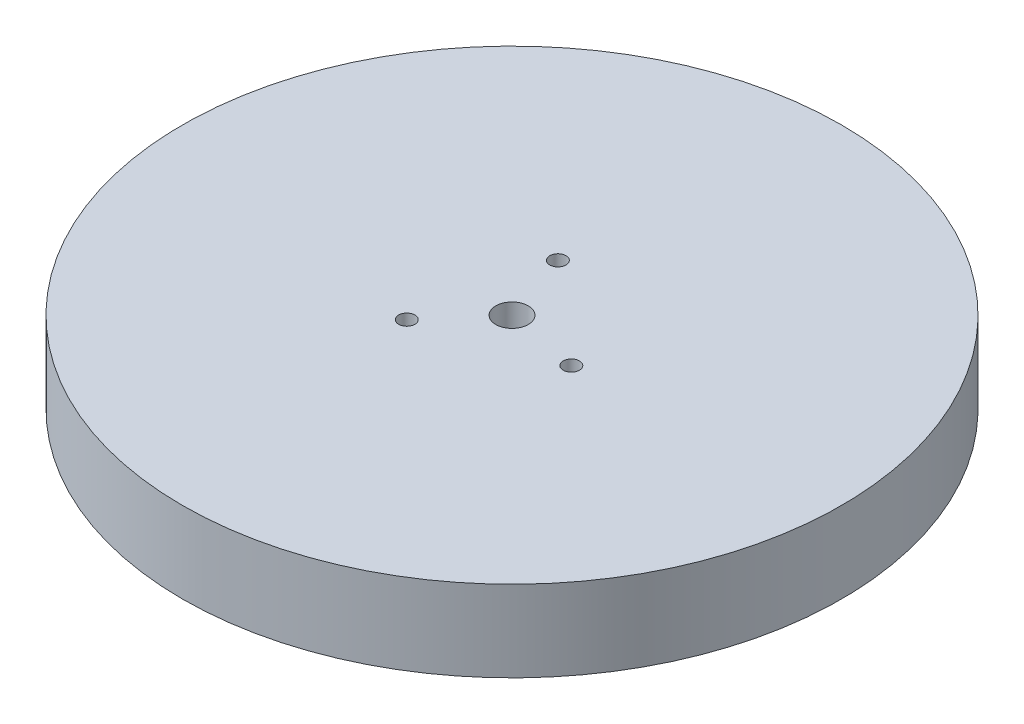
ISO-10303-21;
HEADER;
FILE_DESCRIPTION(('STEP AP214'),'2;1');
FILE_NAME('part.step','',(''),(''),'','','');
FILE_SCHEMA(('AUTOMOTIVE_DESIGN { 1 0 10303 214 1 1 1 1 }'));
ENDSEC;
DATA;
#1=APPLICATION_CONTEXT('core data for automotive mechanical design processes');
#2=APPLICATION_PROTOCOL_DEFINITION('international standard','automotive_design',2000,#1);
#3=PRODUCT_CONTEXT('',#1,'mechanical');
#4=PRODUCT('Part','Part','',(#3));
#5=PRODUCT_RELATED_PRODUCT_CATEGORY('part','',(#4));
#6=PRODUCT_DEFINITION_FORMATION('','',#4);
#7=PRODUCT_DEFINITION_CONTEXT('part definition',#1,'design');
#8=PRODUCT_DEFINITION('design','',#6,#7);
#9=PRODUCT_DEFINITION_SHAPE('','',#8);
#10=(LENGTH_UNIT() NAMED_UNIT(*) SI_UNIT(.MILLI.,.METRE.));
#11=(NAMED_UNIT(*) PLANE_ANGLE_UNIT() SI_UNIT($,.RADIAN.));
#12=(NAMED_UNIT(*) SI_UNIT($,.STERADIAN.) SOLID_ANGLE_UNIT());
#13=UNCERTAINTY_MEASURE_WITH_UNIT(LENGTH_MEASURE(1.E-05),#10,'distance_accuracy_value','');
#14=(GEOMETRIC_REPRESENTATION_CONTEXT(3) GLOBAL_UNCERTAINTY_ASSIGNED_CONTEXT((#13)) GLOBAL_UNIT_ASSIGNED_CONTEXT((#10,
#11,#12)) REPRESENTATION_CONTEXT('',''));
#15=CARTESIAN_POINT('',(0.,0.,0.));
#16=DIRECTION('',(0.,0.,1.));
#17=DIRECTION('',(1.,0.,0.));
#18=AXIS2_PLACEMENT_3D('',#15,#16,#17);
#19=CARTESIAN_POINT('',(0.,25.,0.));
#20=DIRECTION('',(0.,1.,0.));
#21=DIRECTION('',(0.,0.,1.));
#22=AXIS2_PLACEMENT_3D('',#19,#20,#21);
#23=PLANE('',#22);
#24=CARTESIAN_POINT('',(22.5930732102235,25.,4.3073243339085));
#25=DIRECTION('',(0.,-1.,0.));
#26=DIRECTION('',(0.,0.,-1.));
#27=AXIS2_PLACEMENT_3D('',#24,#25,#26);
#28=CIRCLE('',#27,2.5);
#29=CARTESIAN_POINT('',(22.5930732102235,25.,1.80732433390851));
#30=VERTEX_POINT('',#29);
#31=EDGE_CURVE('E57',#30,#30,#28,.T.);
#32=ORIENTED_EDGE('',*,*,#31,.T.);
#33=EDGE_LOOP('',(#32));
#34=FACE_BOUND('',#33,.T.);
#35=CARTESIAN_POINT('',(-7.56628430960807,25.,-21.7198375165695));
#36=DIRECTION('',(0.,-1.,0.));
#37=DIRECTION('',(0.,0.,-1.));
#38=AXIS2_PLACEMENT_3D('',#35,#36,#37);
#39=CIRCLE('',#38,2.5);
#40=CARTESIAN_POINT('',(-7.56628430960807,25.,-24.2198375165695));
#41=VERTEX_POINT('',#40);
#42=EDGE_CURVE('E69',#41,#41,#39,.T.);
#43=ORIENTED_EDGE('',*,*,#42,.T.);
#44=EDGE_LOOP('',(#43));
#45=FACE_BOUND('',#44,.T.);
#46=CARTESIAN_POINT('',(-15.0267889006154,25.,17.412513182661));
#47=DIRECTION('',(0.,-1.,0.));
#48=DIRECTION('',(0.,0.,-1.));
#49=AXIS2_PLACEMENT_3D('',#46,#47,#48);
#50=CIRCLE('',#49,2.5);
#51=CARTESIAN_POINT('',(-15.0267889006154,25.,14.912513182661));
#52=VERTEX_POINT('',#51);
#53=EDGE_CURVE('E63',#52,#52,#50,.T.);
#54=ORIENTED_EDGE('',*,*,#53,.T.);
#55=EDGE_LOOP('',(#54));
#56=FACE_BOUND('',#55,.T.);
#57=CARTESIAN_POINT('',(0.,25.,0.));
#58=DIRECTION('',(0.,1.,0.));
#59=DIRECTION('',(0.,0.,1.));
#60=AXIS2_PLACEMENT_3D('',#57,#58,#59);
#61=CIRCLE('',#60,101.6);
#62=CARTESIAN_POINT('',(0.,25.,101.6));
#63=VERTEX_POINT('',#62);
#64=EDGE_CURVE('E11',#63,#63,#61,.T.);
#65=ORIENTED_EDGE('',*,*,#64,.T.);
#66=EDGE_LOOP('',(#65));
#67=FACE_BOUND('',#66,.T.);
#68=CARTESIAN_POINT('',(0.,25.,0.));
#69=DIRECTION('',(0.,1.,0.));
#70=DIRECTION('',(0.,0.,1.));
#71=AXIS2_PLACEMENT_3D('',#68,#69,#70);
#72=CIRCLE('',#71,5.);
#73=CARTESIAN_POINT('',(0.,25.,5.));
#74=VERTEX_POINT('',#73);
#75=EDGE_CURVE('E52',#74,#74,#72,.T.);
#76=ORIENTED_EDGE('',*,*,#75,.F.);
#77=EDGE_LOOP('',(#76));
#78=FACE_BOUND('',#77,.T.);
#79=ADVANCED_FACE('F41',(#34,#45,#56,#67,#78),#23,.T.);
#80=CARTESIAN_POINT('',(0.,0.,0.));
#81=DIRECTION('',(0.,1.,0.));
#82=DIRECTION('',(0.,0.,1.));
#83=AXIS2_PLACEMENT_3D('',#80,#81,#82);
#84=PLANE('',#83);
#85=CARTESIAN_POINT('',(22.5930732102235,0.,4.3073243339085));
#86=DIRECTION('',(0.,-1.,0.));
#87=DIRECTION('',(0.,0.,-1.));
#88=AXIS2_PLACEMENT_3D('',#85,#86,#87);
#89=CIRCLE('',#88,2.5);
#90=CARTESIAN_POINT('',(22.5930732102235,0.,1.80732433390851));
#91=VERTEX_POINT('',#90);
#92=EDGE_CURVE('E72',#91,#91,#89,.T.);
#93=ORIENTED_EDGE('',*,*,#92,.F.);
#94=EDGE_LOOP('',(#93));
#95=FACE_BOUND('',#94,.T.);
#96=CARTESIAN_POINT('',(-7.56628430960807,0.,-21.7198375165695));
#97=DIRECTION('',(0.,-1.,0.));
#98=DIRECTION('',(0.,0.,-1.));
#99=AXIS2_PLACEMENT_3D('',#96,#97,#98);
#100=CIRCLE('',#99,2.5);
#101=CARTESIAN_POINT('',(-7.56628430960807,0.,-24.2198375165695));
#102=VERTEX_POINT('',#101);
#103=EDGE_CURVE('E66',#102,#102,#100,.T.);
#104=ORIENTED_EDGE('',*,*,#103,.F.);
#105=EDGE_LOOP('',(#104));
#106=FACE_BOUND('',#105,.T.);
#107=CARTESIAN_POINT('',(-15.0267889006154,0.,17.412513182661));
#108=DIRECTION('',(0.,-1.,0.));
#109=DIRECTION('',(0.,0.,-1.));
#110=AXIS2_PLACEMENT_3D('',#107,#108,#109);
#111=CIRCLE('',#110,2.5);
#112=CARTESIAN_POINT('',(-15.0267889006154,0.,14.912513182661));
#113=VERTEX_POINT('',#112);
#114=EDGE_CURVE('E60',#113,#113,#111,.T.);
#115=ORIENTED_EDGE('',*,*,#114,.F.);
#116=EDGE_LOOP('',(#115));
#117=FACE_BOUND('',#116,.T.);
#118=CARTESIAN_POINT('',(0.,0.,0.));
#119=DIRECTION('',(0.,1.,0.));
#120=DIRECTION('',(0.,0.,1.));
#121=AXIS2_PLACEMENT_3D('',#118,#119,#120);
#122=CIRCLE('',#121,101.6);
#123=CARTESIAN_POINT('',(0.,0.,101.6));
#124=VERTEX_POINT('',#123);
#125=EDGE_CURVE('E45',#124,#124,#122,.T.);
#126=ORIENTED_EDGE('',*,*,#125,.F.);
#127=EDGE_LOOP('',(#126));
#128=FACE_BOUND('',#127,.T.);
#129=CARTESIAN_POINT('',(0.,0.,0.));
#130=DIRECTION('',(0.,1.,0.));
#131=DIRECTION('',(0.,0.,1.));
#132=AXIS2_PLACEMENT_3D('',#129,#130,#131);
#133=CIRCLE('',#132,5.);
#134=CARTESIAN_POINT('',(0.,0.,5.));
#135=VERTEX_POINT('',#134);
#136=EDGE_CURVE('E54',#135,#135,#133,.T.);
#137=ORIENTED_EDGE('',*,*,#136,.T.);
#138=EDGE_LOOP('',(#137));
#139=FACE_BOUND('',#138,.T.);
#140=ADVANCED_FACE('F87',(#95,#106,#117,#128,#139),#84,.F.);
#141=CARTESIAN_POINT('',(0.,25.,0.));
#142=DIRECTION('',(0.,-1.,0.));
#143=DIRECTION('',(0.,0.,-1.));
#144=AXIS2_PLACEMENT_3D('',#141,#142,#143);
#145=CYLINDRICAL_SURFACE('',#144,101.6);
#146=ORIENTED_EDGE('',*,*,#64,.F.);
#147=EDGE_LOOP('',(#146));
#148=FACE_BOUND('',#147,.T.);
#149=ORIENTED_EDGE('',*,*,#125,.T.);
#150=EDGE_LOOP('',(#149));
#151=FACE_BOUND('',#150,.T.);
#152=ADVANCED_FACE('F43',(#148,#151),#145,.T.);
#153=CARTESIAN_POINT('',(0.,25.,0.));
#154=DIRECTION('',(0.,-1.,0.));
#155=DIRECTION('',(0.,0.,-1.));
#156=AXIS2_PLACEMENT_3D('',#153,#154,#155);
#157=CYLINDRICAL_SURFACE('',#156,5.);
#158=ORIENTED_EDGE('',*,*,#75,.T.);
#159=EDGE_LOOP('',(#158));
#160=FACE_BOUND('',#159,.T.);
#161=ORIENTED_EDGE('',*,*,#136,.F.);
#162=EDGE_LOOP('',(#161));
#163=FACE_BOUND('',#162,.T.);
#164=ADVANCED_FACE('F98',(#160,#163),#157,.F.);
#165=CARTESIAN_POINT('',(-15.0267889006154,25.,17.412513182661));
#166=DIRECTION('',(0.,-1.,0.));
#167=DIRECTION('',(0.,0.,-1.));
#168=AXIS2_PLACEMENT_3D('',#165,#166,#167);
#169=CYLINDRICAL_SURFACE('',#168,2.5);
#170=ORIENTED_EDGE('',*,*,#53,.F.);
#171=EDGE_LOOP('',(#170));
#172=FACE_BOUND('',#171,.T.);
#173=ORIENTED_EDGE('',*,*,#114,.T.);
#174=EDGE_LOOP('',(#173));
#175=FACE_BOUND('',#174,.T.);
#176=ADVANCED_FACE('F100',(#172,#175),#169,.F.);
#177=CARTESIAN_POINT('',(-7.56628430960807,25.,-21.7198375165695));
#178=DIRECTION('',(0.,-1.,0.));
#179=DIRECTION('',(0.,0.,-1.));
#180=AXIS2_PLACEMENT_3D('',#177,#178,#179);
#181=CYLINDRICAL_SURFACE('',#180,2.5);
#182=ORIENTED_EDGE('',*,*,#42,.F.);
#183=EDGE_LOOP('',(#182));
#184=FACE_BOUND('',#183,.T.);
#185=ORIENTED_EDGE('',*,*,#103,.T.);
#186=EDGE_LOOP('',(#185));
#187=FACE_BOUND('',#186,.T.);
#188=ADVANCED_FACE('F83',(#184,#187),#181,.F.);
#189=CARTESIAN_POINT('',(22.5930732102235,25.,4.3073243339085));
#190=DIRECTION('',(0.,-1.,0.));
#191=DIRECTION('',(0.,0.,-1.));
#192=AXIS2_PLACEMENT_3D('',#189,#190,#191);
#193=CYLINDRICAL_SURFACE('',#192,2.5);
#194=ORIENTED_EDGE('',*,*,#31,.F.);
#195=EDGE_LOOP('',(#194));
#196=FACE_BOUND('',#195,.T.);
#197=ORIENTED_EDGE('',*,*,#92,.T.);
#198=EDGE_LOOP('',(#197));
#199=FACE_BOUND('',#198,.T.);
#200=ADVANCED_FACE('F80',(#196,#199),#193,.F.);
#201=CLOSED_SHELL('',(#79,#140,#152,#164,#176,#188,#200));
#202=MANIFOLD_SOLID_BREP('B2',#201);
#203=ADVANCED_BREP_SHAPE_REPRESENTATION('',(#18,#202),#14);
#204=SHAPE_DEFINITION_REPRESENTATION(#9,#203);
ENDSEC;
END-ISO-10303-21;
